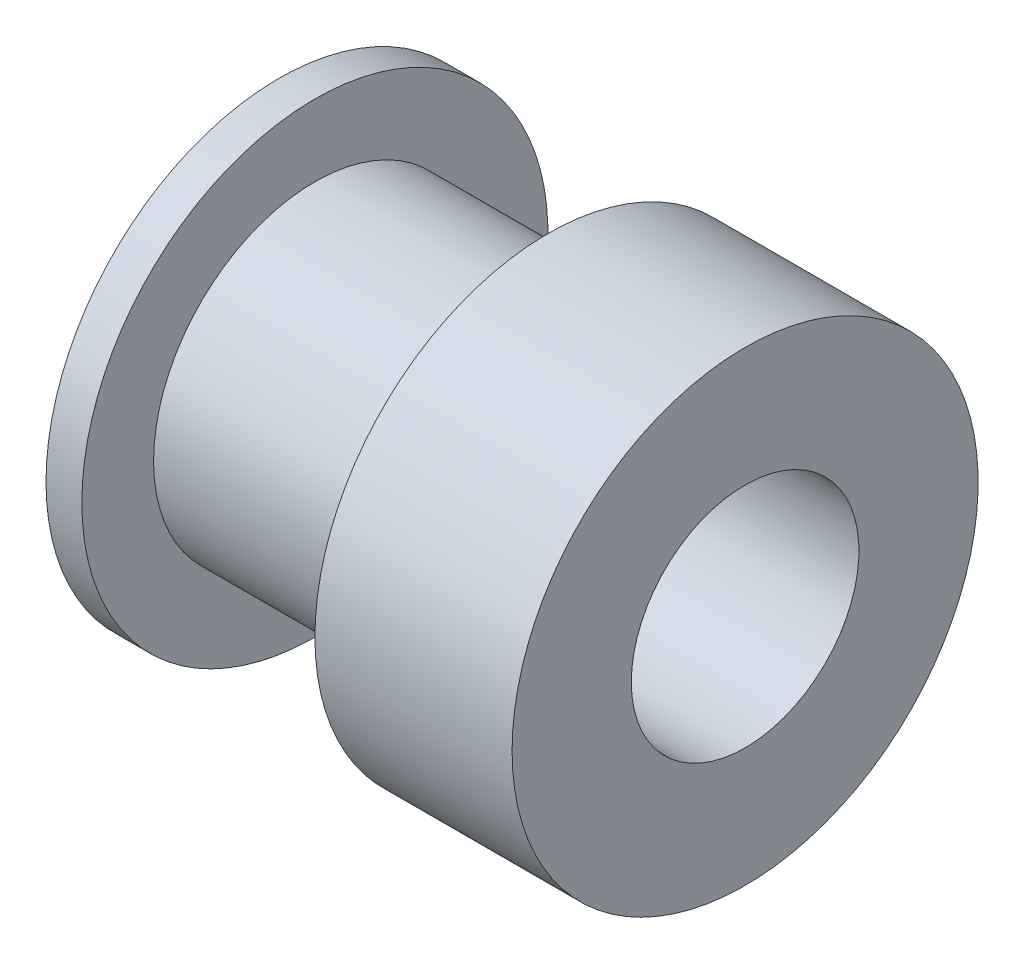
ISO-10303-21;
HEADER;
FILE_DESCRIPTION(('STEP AP214'),'2;1');
FILE_NAME('part.step','',(''),(''),'','','');
FILE_SCHEMA(('AUTOMOTIVE_DESIGN { 1 0 10303 214 1 1 1 1 }'));
ENDSEC;
DATA;
#1=APPLICATION_CONTEXT('core data for automotive mechanical design processes');
#2=APPLICATION_PROTOCOL_DEFINITION('international standard','automotive_design',2000,#1);
#3=PRODUCT_CONTEXT('',#1,'mechanical');
#4=PRODUCT('Part','Part','',(#3));
#5=PRODUCT_RELATED_PRODUCT_CATEGORY('part','',(#4));
#6=PRODUCT_DEFINITION_FORMATION('','',#4);
#7=PRODUCT_DEFINITION_CONTEXT('part definition',#1,'design');
#8=PRODUCT_DEFINITION('design','',#6,#7);
#9=PRODUCT_DEFINITION_SHAPE('','',#8);
#10=(LENGTH_UNIT() NAMED_UNIT(*) SI_UNIT(.MILLI.,.METRE.));
#11=(NAMED_UNIT(*) PLANE_ANGLE_UNIT() SI_UNIT($,.RADIAN.));
#12=(NAMED_UNIT(*) SI_UNIT($,.STERADIAN.) SOLID_ANGLE_UNIT());
#13=UNCERTAINTY_MEASURE_WITH_UNIT(LENGTH_MEASURE(1.E-05),#10,'distance_accuracy_value','');
#14=(GEOMETRIC_REPRESENTATION_CONTEXT(3) GLOBAL_UNCERTAINTY_ASSIGNED_CONTEXT((#13)) GLOBAL_UNIT_ASSIGNED_CONTEXT((#10,
#11,#12)) REPRESENTATION_CONTEXT('',''));
#15=CARTESIAN_POINT('',(0.,0.,0.));
#16=DIRECTION('',(0.,0.,1.));
#17=DIRECTION('',(1.,0.,0.));
#18=AXIS2_PLACEMENT_3D('',#15,#16,#17);
#19=CARTESIAN_POINT('',(6.5,3.25,0.));
#20=DIRECTION('',(-1.,0.,0.));
#21=DIRECTION('',(0.,0.,1.));
#22=AXIS2_PLACEMENT_3D('',#19,#20,#21);
#23=PLANE('',#22);
#24=CARTESIAN_POINT('',(6.5,-3.25,0.));
#25=DIRECTION('',(-1.,0.,0.));
#26=DIRECTION('',(0.,0.,1.));
#27=AXIS2_PLACEMENT_3D('',#24,#25,#26);
#28=CIRCLE('',#27,3.175);
#29=CARTESIAN_POINT('',(6.5,-3.25,3.175));
#30=VERTEX_POINT('',#29);
#31=EDGE_CURVE('E63',#30,#30,#28,.T.);
#32=ORIENTED_EDGE('',*,*,#31,.T.);
#33=EDGE_LOOP('',(#32));
#34=FACE_BOUND('',#33,.T.);
#35=CARTESIAN_POINT('',(6.5,-3.25,0.));
#36=DIRECTION('',(-1.,0.,0.));
#37=DIRECTION('',(0.,0.,1.));
#38=AXIS2_PLACEMENT_3D('',#35,#36,#37);
#39=CIRCLE('',#38,6.5);
#40=CARTESIAN_POINT('',(6.5,-3.25,6.5));
#41=VERTEX_POINT('',#40);
#42=EDGE_CURVE('E60',#41,#41,#39,.T.);
#43=ORIENTED_EDGE('',*,*,#42,.F.);
#44=EDGE_LOOP('',(#43));
#45=FACE_BOUND('',#44,.T.);
#46=ADVANCED_FACE('F38',(#34,#45),#23,.F.);
#47=CARTESIAN_POINT('',(-6.5,3.25,0.));
#48=DIRECTION('',(1.,0.,0.));
#49=DIRECTION('',(0.,0.,-1.));
#50=AXIS2_PLACEMENT_3D('',#47,#48,#49);
#51=PLANE('',#50);
#52=CARTESIAN_POINT('',(-6.5,-3.25,0.));
#53=DIRECTION('',(-1.,0.,0.));
#54=DIRECTION('',(0.,0.,1.));
#55=AXIS2_PLACEMENT_3D('',#52,#53,#54);
#56=CIRCLE('',#55,3.175);
#57=CARTESIAN_POINT('',(-6.5,-3.25,3.175));
#58=VERTEX_POINT('',#57);
#59=EDGE_CURVE('E64',#58,#58,#56,.T.);
#60=ORIENTED_EDGE('',*,*,#59,.F.);
#61=EDGE_LOOP('',(#60));
#62=FACE_BOUND('',#61,.T.);
#63=CARTESIAN_POINT('',(-6.5,-3.25,0.));
#64=DIRECTION('',(-1.,0.,0.));
#65=DIRECTION('',(0.,0.,1.));
#66=AXIS2_PLACEMENT_3D('',#63,#64,#65);
#67=CIRCLE('',#66,6.5);
#68=CARTESIAN_POINT('',(-6.5,-3.25,6.5));
#69=VERTEX_POINT('',#68);
#70=EDGE_CURVE('E10',#69,#69,#67,.T.);
#71=ORIENTED_EDGE('',*,*,#70,.T.);
#72=EDGE_LOOP('',(#71));
#73=FACE_BOUND('',#72,.T.);
#74=ADVANCED_FACE('F79',(#62,#73),#51,.F.);
#75=CARTESIAN_POINT('',(-6.5,-3.25,0.));
#76=DIRECTION('',(-1.,0.,0.));
#77=DIRECTION('',(0.,0.,1.));
#78=AXIS2_PLACEMENT_3D('',#75,#76,#77);
#79=CYLINDRICAL_SURFACE('',#78,6.5);
#80=ORIENTED_EDGE('',*,*,#70,.F.);
#81=EDGE_LOOP('',(#80));
#82=FACE_BOUND('',#81,.T.);
#83=CARTESIAN_POINT('',(-5.5,-3.25,0.));
#84=DIRECTION('',(-1.,0.,0.));
#85=DIRECTION('',(0.,0.,1.));
#86=AXIS2_PLACEMENT_3D('',#83,#84,#85);
#87=CIRCLE('',#86,6.5);
#88=CARTESIAN_POINT('',(-5.5,-3.25,6.5));
#89=VERTEX_POINT('',#88);
#90=EDGE_CURVE('E44',#89,#89,#87,.T.);
#91=ORIENTED_EDGE('',*,*,#90,.T.);
#92=EDGE_LOOP('',(#91));
#93=FACE_BOUND('',#92,.T.);
#94=ADVANCED_FACE('F81',(#82,#93),#79,.T.);
#95=CARTESIAN_POINT('',(-5.5,3.25,0.));
#96=DIRECTION('',(-1.,0.,0.));
#97=DIRECTION('',(0.,0.,1.));
#98=AXIS2_PLACEMENT_3D('',#95,#96,#97);
#99=PLANE('',#98);
#100=ORIENTED_EDGE('',*,*,#90,.F.);
#101=EDGE_LOOP('',(#100));
#102=FACE_BOUND('',#101,.T.);
#103=CARTESIAN_POINT('',(-5.5,-3.25,0.));
#104=DIRECTION('',(-1.,0.,0.));
#105=DIRECTION('',(0.,0.,1.));
#106=AXIS2_PLACEMENT_3D('',#103,#104,#105);
#107=CIRCLE('',#106,4.5);
#108=CARTESIAN_POINT('',(-5.5,-3.25,4.5));
#109=VERTEX_POINT('',#108);
#110=EDGE_CURVE('E48',#109,#109,#107,.T.);
#111=ORIENTED_EDGE('',*,*,#110,.T.);
#112=EDGE_LOOP('',(#111));
#113=FACE_BOUND('',#112,.T.);
#114=ADVANCED_FACE('F86',(#102,#113),#99,.F.);
#115=CARTESIAN_POINT('',(-6.5,-3.25,0.));
#116=DIRECTION('',(-1.,0.,0.));
#117=DIRECTION('',(0.,0.,1.));
#118=AXIS2_PLACEMENT_3D('',#115,#116,#117);
#119=CYLINDRICAL_SURFACE('',#118,4.5);
#120=ORIENTED_EDGE('',*,*,#110,.F.);
#121=EDGE_LOOP('',(#120));
#122=FACE_BOUND('',#121,.T.);
#123=CARTESIAN_POINT('',(0.999999999999999,-3.25,0.));
#124=DIRECTION('',(-1.,0.,0.));
#125=DIRECTION('',(0.,0.,1.));
#126=AXIS2_PLACEMENT_3D('',#123,#124,#125);
#127=CIRCLE('',#126,4.5);
#128=CARTESIAN_POINT('',(0.999999999999999,-3.25,4.5));
#129=VERTEX_POINT('',#128);
#130=EDGE_CURVE('E52',#129,#129,#127,.T.);
#131=ORIENTED_EDGE('',*,*,#130,.T.);
#132=EDGE_LOOP('',(#131));
#133=FACE_BOUND('',#132,.T.);
#134=ADVANCED_FACE('F92',(#122,#133),#119,.T.);
#135=CARTESIAN_POINT('',(0.999999999999999,1.25,0.));
#136=DIRECTION('',(1.,0.,0.));
#137=DIRECTION('',(0.,0.,-1.));
#138=AXIS2_PLACEMENT_3D('',#135,#136,#137);
#139=PLANE('',#138);
#140=ORIENTED_EDGE('',*,*,#130,.F.);
#141=EDGE_LOOP('',(#140));
#142=FACE_BOUND('',#141,.T.);
#143=CARTESIAN_POINT('',(0.999999999999999,-3.25,0.));
#144=DIRECTION('',(-1.,0.,0.));
#145=DIRECTION('',(0.,0.,1.));
#146=AXIS2_PLACEMENT_3D('',#143,#144,#145);
#147=CIRCLE('',#146,6.5);
#148=CARTESIAN_POINT('',(0.999999999999999,-3.25,6.5));
#149=VERTEX_POINT('',#148);
#150=EDGE_CURVE('E57',#149,#149,#147,.T.);
#151=ORIENTED_EDGE('',*,*,#150,.T.);
#152=EDGE_LOOP('',(#151));
#153=FACE_BOUND('',#152,.T.);
#154=ADVANCED_FACE('F96',(#142,#153),#139,.F.);
#155=CARTESIAN_POINT('',(-6.5,-3.25,0.));
#156=DIRECTION('',(-1.,0.,0.));
#157=DIRECTION('',(0.,0.,1.));
#158=AXIS2_PLACEMENT_3D('',#155,#156,#157);
#159=CYLINDRICAL_SURFACE('',#158,6.5);
#160=ORIENTED_EDGE('',*,*,#150,.F.);
#161=EDGE_LOOP('',(#160));
#162=FACE_BOUND('',#161,.T.);
#163=ORIENTED_EDGE('',*,*,#42,.T.);
#164=EDGE_LOOP('',(#163));
#165=FACE_BOUND('',#164,.T.);
#166=ADVANCED_FACE('F75',(#162,#165),#159,.T.);
#167=CARTESIAN_POINT('',(6.5,-3.25,0.));
#168=DIRECTION('',(-1.,0.,0.));
#169=DIRECTION('',(0.,0.,1.));
#170=AXIS2_PLACEMENT_3D('',#167,#168,#169);
#171=CYLINDRICAL_SURFACE('',#170,3.175);
#172=ORIENTED_EDGE('',*,*,#31,.F.);
#173=EDGE_LOOP('',(#172));
#174=FACE_BOUND('',#173,.T.);
#175=ORIENTED_EDGE('',*,*,#59,.T.);
#176=EDGE_LOOP('',(#175));
#177=FACE_BOUND('',#176,.T.);
#178=ADVANCED_FACE('F72',(#174,#177),#171,.F.);
#179=CLOSED_SHELL('',(#46,#74,#94,#114,#134,#154,#166,#178));
#180=MANIFOLD_SOLID_BREP('B2',#179);
#181=ADVANCED_BREP_SHAPE_REPRESENTATION('',(#18,#180),#14);
#182=SHAPE_DEFINITION_REPRESENTATION(#9,#181);
ENDSEC;
END-ISO-10303-21;
